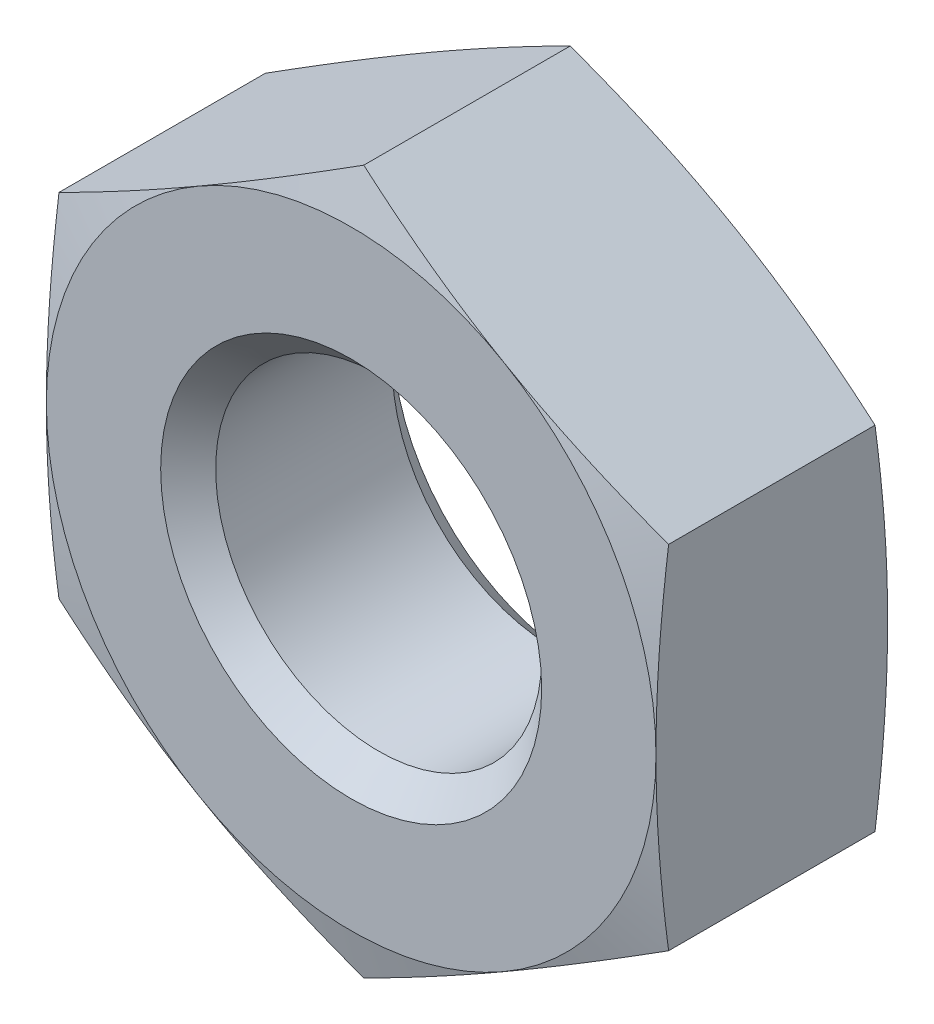
ISO-10303-21;
HEADER;
FILE_DESCRIPTION(('STEP AP214'),'2;1');
FILE_NAME('part.step','',(''),(''),'','','');
FILE_SCHEMA(('AUTOMOTIVE_DESIGN { 1 0 10303 214 1 1 1 1 }'));
ENDSEC;
DATA;
#1=APPLICATION_CONTEXT('core data for automotive mechanical design processes');
#2=APPLICATION_PROTOCOL_DEFINITION('international standard','automotive_design',2000,#1);
#3=PRODUCT_CONTEXT('',#1,'mechanical');
#4=PRODUCT('Part','Part','',(#3));
#5=PRODUCT_RELATED_PRODUCT_CATEGORY('part','',(#4));
#6=PRODUCT_DEFINITION_FORMATION('','',#4);
#7=PRODUCT_DEFINITION_CONTEXT('part definition',#1,'design');
#8=PRODUCT_DEFINITION('design','',#6,#7);
#9=PRODUCT_DEFINITION_SHAPE('','',#8);
#10=(LENGTH_UNIT() NAMED_UNIT(*) SI_UNIT(.MILLI.,.METRE.));
#11=(NAMED_UNIT(*) PLANE_ANGLE_UNIT() SI_UNIT($,.RADIAN.));
#12=(NAMED_UNIT(*) SI_UNIT($,.STERADIAN.) SOLID_ANGLE_UNIT());
#13=UNCERTAINTY_MEASURE_WITH_UNIT(LENGTH_MEASURE(1.E-05),#10,'distance_accuracy_value','');
#14=(GEOMETRIC_REPRESENTATION_CONTEXT(3) GLOBAL_UNCERTAINTY_ASSIGNED_CONTEXT((#13)) GLOBAL_UNIT_ASSIGNED_CONTEXT((#10,
#11,#12)) REPRESENTATION_CONTEXT('',''));
#15=CARTESIAN_POINT('',(0.,0.,0.));
#16=DIRECTION('',(0.,0.,1.));
#17=DIRECTION('',(1.,0.,0.));
#18=AXIS2_PLACEMENT_3D('',#15,#16,#17);
#19=CARTESIAN_POINT('',(0.,0.,0.));
#20=DIRECTION('',(0.,0.,-1.));
#21=DIRECTION('',(-1.,0.,0.));
#22=AXIS2_PLACEMENT_3D('',#19,#20,#21);
#23=PLANE('',#22);
#24=CARTESIAN_POINT('',(0.,0.,0.));
#25=DIRECTION('',(0.,0.,1.));
#26=DIRECTION('',(1.,0.,0.));
#27=AXIS2_PLACEMENT_3D('',#24,#25,#26);
#28=CIRCLE('',#27,6.35);
#29=CARTESIAN_POINT('',(6.35,0.,0.));
#30=VERTEX_POINT('',#29);
#31=CARTESIAN_POINT('',(3.17499999999997,5.49926131403117,0.));
#32=VERTEX_POINT('',#31);
#33=EDGE_CURVE('E11',#30,#32,#28,.T.);
#34=ORIENTED_EDGE('',*,*,#33,.T.);
#35=CARTESIAN_POINT('',(-3.17499999999997,5.49926131403117,0.));
#36=VERTEX_POINT('',#35);
#37=EDGE_CURVE('E43',#32,#36,#28,.T.);
#38=ORIENTED_EDGE('',*,*,#37,.T.);
#39=CARTESIAN_POINT('',(-6.35,0.,0.));
#40=VERTEX_POINT('',#39);
#41=EDGE_CURVE('E328',#36,#40,#28,.T.);
#42=ORIENTED_EDGE('',*,*,#41,.T.);
#43=CARTESIAN_POINT('',(-3.17499999999997,-5.49926131403117,0.));
#44=VERTEX_POINT('',#43);
#45=EDGE_CURVE('E321',#40,#44,#28,.T.);
#46=ORIENTED_EDGE('',*,*,#45,.T.);
#47=CARTESIAN_POINT('',(3.17499999999997,-5.49926131403117,0.));
#48=VERTEX_POINT('',#47);
#49=EDGE_CURVE('E324',#44,#48,#28,.T.);
#50=ORIENTED_EDGE('',*,*,#49,.T.);
#51=EDGE_CURVE('E44',#48,#30,#28,.T.);
#52=ORIENTED_EDGE('',*,*,#51,.T.);
#53=EDGE_LOOP('',(#34,#38,#42,#46,#50,#52));
#54=FACE_BOUND('',#53,.T.);
#55=CARTESIAN_POINT('',(0.,0.,0.));
#56=DIRECTION('',(0.,0.,1.));
#57=DIRECTION('',(1.,0.,0.));
#58=AXIS2_PLACEMENT_3D('',#55,#56,#57);
#59=CIRCLE('',#58,3.96875);
#60=CARTESIAN_POINT('',(3.96875,0.,0.));
#61=VERTEX_POINT('',#60);
#62=EDGE_CURVE('E185',#61,#61,#59,.T.);
#63=ORIENTED_EDGE('',*,*,#62,.F.);
#64=EDGE_LOOP('',(#63));
#65=FACE_BOUND('',#64,.T.);
#66=ADVANCED_FACE('F36',(#54,#65),#23,.F.);
#67=CARTESIAN_POINT('',(0.,6.35,-4.826));
#68=DIRECTION('',(0.,0.,1.));
#69=DIRECTION('',(1.,0.,0.));
#70=AXIS2_PLACEMENT_3D('',#67,#68,#69);
#71=PLANE('',#70);
#72=CARTESIAN_POINT('',(0.,0.,-4.826));
#73=DIRECTION('',(0.,0.,1.));
#74=DIRECTION('',(1.,0.,0.));
#75=AXIS2_PLACEMENT_3D('',#72,#73,#74);
#76=CIRCLE('',#75,6.35);
#77=CARTESIAN_POINT('',(6.35,0.,-4.826));
#78=VERTEX_POINT('',#77);
#79=CARTESIAN_POINT('',(3.17499999999997,5.49926131403117,-4.826));
#80=VERTEX_POINT('',#79);
#81=EDGE_CURVE('E359',#78,#80,#76,.T.);
#82=ORIENTED_EDGE('',*,*,#81,.F.);
#83=CARTESIAN_POINT('',(3.17499999999997,-5.49926131403117,-4.826));
#84=VERTEX_POINT('',#83);
#85=EDGE_CURVE('E362',#84,#78,#76,.T.);
#86=ORIENTED_EDGE('',*,*,#85,.F.);
#87=CARTESIAN_POINT('',(-3.17499999999997,-5.49926131403117,-4.826));
#88=VERTEX_POINT('',#87);
#89=EDGE_CURVE('E363',#88,#84,#76,.T.);
#90=ORIENTED_EDGE('',*,*,#89,.F.);
#91=CARTESIAN_POINT('',(-6.35,0.,-4.826));
#92=VERTEX_POINT('',#91);
#93=EDGE_CURVE('E143',#92,#88,#76,.T.);
#94=ORIENTED_EDGE('',*,*,#93,.F.);
#95=CARTESIAN_POINT('',(-3.17499999999997,5.49926131403117,-4.826));
#96=VERTEX_POINT('',#95);
#97=EDGE_CURVE('E360',#96,#92,#76,.T.);
#98=ORIENTED_EDGE('',*,*,#97,.F.);
#99=EDGE_CURVE('E356',#80,#96,#76,.T.);
#100=ORIENTED_EDGE('',*,*,#99,.F.);
#101=EDGE_LOOP('',(#82,#86,#90,#94,#98,#100));
#102=FACE_BOUND('',#101,.T.);
#103=CARTESIAN_POINT('',(0.,0.,-4.826));
#104=DIRECTION('',(0.,0.,1.));
#105=DIRECTION('',(1.,0.,0.));
#106=AXIS2_PLACEMENT_3D('',#103,#104,#105);
#107=CIRCLE('',#106,3.96875);
#108=CARTESIAN_POINT('',(3.96875,0.,-4.826));
#109=VERTEX_POINT('',#108);
#110=EDGE_CURVE('E205',#109,#109,#107,.T.);
#111=ORIENTED_EDGE('',*,*,#110,.T.);
#112=EDGE_LOOP('',(#111));
#113=FACE_BOUND('',#112,.T.);
#114=ADVANCED_FACE('F209',(#102,#113),#71,.F.);
#115=CARTESIAN_POINT('',(0.,0.,-0.34029547438753));
#116=DIRECTION('',(0.,0.,-1.));
#117=DIRECTION('',(-1.,0.,0.));
#118=AXIS2_PLACEMENT_3D('',#115,#116,#117);
#119=CONICAL_SURFACE('',#118,7.62,1.30899693899574);
#120=CARTESIAN_POINT('',(-6.3502,3.66605873930026,-0.263250406317398));
#121=CARTESIAN_POINT('',(-6.08648388036055,3.81831531196374,-0.222436017819721));
#122=CARTESIAN_POINT('',(-5.82228961017329,3.97084794497471,-0.185383274224434));
#123=CARTESIAN_POINT('',(-5.29296803853939,4.27645189684542,-0.120285061182736));
#124=CARTESIAN_POINT('',(-5.02784040218128,4.42952340906638,-0.0922432503895779));
#125=CARTESIAN_POINT('',(-4.49825958402999,4.73527703698369,-0.0468039793310918));
#126=CARTESIAN_POINT('',(-4.23380998333527,4.88795708513187,-0.0293523302928602));
#127=CARTESIAN_POINT('',(-3.70457353831061,5.19351188913182,-0.00595145337441143));
#128=CARTESIAN_POINT('',(-3.4397867691553,5.34638660158149,0.));
#129=CARTESIAN_POINT('',(-2.9102132308447,5.65213602648081,0.));
#130=CARTESIAN_POINT('',(-2.64542646168939,5.80501073893048,-0.0059514533744095));
#131=CARTESIAN_POINT('',(-2.11619001666473,6.11056554293043,-0.0293523302928565));
#132=CARTESIAN_POINT('',(-1.85174041597001,6.26324559107861,-0.0468039793310874));
#133=CARTESIAN_POINT('',(-1.32215959781872,6.56899921899592,-0.092243250389572));
#134=CARTESIAN_POINT('',(-1.05703196146061,6.72207073121688,-0.120285061182729));
#135=CARTESIAN_POINT('',(-0.527710389826715,7.02767468308759,-0.185383274224426));
#136=CARTESIAN_POINT('',(-0.263516119639453,7.18020731609856,-0.222436017819712));
#137=CARTESIAN_POINT('',(0.000199999999999172,7.33246388876204,-0.263250406317389));
#138=B_SPLINE_CURVE_WITH_KNOTS('',3,(#120,#121,#122,#123,#124,#125,#126,#127,#128,#129,#130,
#131,#132,#133,#134,#135,#136,#137),.UNSPECIFIED.,.F.,.F.,(4,2,2,2,2,2,2,2,4),(0.,
0.921756832598808,1.84388744891418,2.76125893137181,3.6784528682018,4.5956468050318,
5.51301828748942,6.43514890380479,7.3569057364036),.UNSPECIFIED.);
#139=CARTESIAN_POINT('',(-6.35,3.6661742093541,-0.263219465478865));
#140=VERTEX_POINT('',#139);
#141=EDGE_CURVE('E336',#140,#36,#138,.T.);
#142=ORIENTED_EDGE('',*,*,#141,.F.);
#143=CARTESIAN_POINT('',(-6.35,-9.69838426805785,-1.40466702488971));
#144=CARTESIAN_POINT('',(-6.35,-9.41030301778577,-1.34010443577546));
#145=CARTESIAN_POINT('',(-6.35,-9.12204158174623,-1.27633145008312));
#146=CARTESIAN_POINT('',(-6.35,-8.54506984640149,-1.15079089411719));
#147=CARTESIAN_POINT('',(-6.35,-8.25635952827311,-1.08902341045539));
#148=CARTESIAN_POINT('',(-6.35,-7.67814291234007,-0.967866314966913));
#149=CARTESIAN_POINT('',(-6.35,-7.3886361115347,-0.908479095146425));
#150=CARTESIAN_POINT('',(-6.35,-6.80901992928611,-0.792723548009877));
#151=CARTESIAN_POINT('',(-6.35,-6.51891055295002,-0.736355195214979));
#152=CARTESIAN_POINT('',(-6.35,-5.94029809901698,-0.627790684302113));
#153=CARTESIAN_POINT('',(-6.35,-5.65180060822269,-0.575564896732133));
#154=CARTESIAN_POINT('',(-6.35,-5.07401869356081,-0.475672890671666));
#155=CARTESIAN_POINT('',(-6.35,-4.78473428715288,-0.428006571853227));
#156=CARTESIAN_POINT('',(-6.35,-4.20532238402886,-0.338306756100279));
#157=CARTESIAN_POINT('',(-6.35,-3.91519499560399,-0.296272565730986));
#158=CARTESIAN_POINT('',(-6.35,-3.33401697616172,-0.219075685672323));
#159=CARTESIAN_POINT('',(-6.35,-3.04296634427965,-0.183913002420567));
#160=CARTESIAN_POINT('',(-6.35,-2.45665824634269,-0.121454817676818));
#161=CARTESIAN_POINT('',(-6.35,-2.16139060466994,-0.0942534192876337));
#162=CARTESIAN_POINT('',(-6.35,-1.57011301394939,-0.0495943084176451));
#163=CARTESIAN_POINT('',(-6.35,-1.27410308208168,-0.0321363724800896));
#164=CARTESIAN_POINT('',(-6.35,-0.681770300562421,-0.00798240375551781));
#165=CARTESIAN_POINT('',(-6.35,-0.385447654437733,-0.00128148035654096));
#166=CARTESIAN_POINT('',(-6.35,0.207240251875498,0.000946477245870253));
#167=CARTESIAN_POINT('',(-6.35,0.503605512027085,-0.00352647891836721));
#168=CARTESIAN_POINT('',(-6.35,1.09704066442558,-0.023394736931719));
#169=CARTESIAN_POINT('',(-6.35,1.39410920235126,-0.0388296802873379));
#170=CARTESIAN_POINT('',(-6.35,1.98754764225961,-0.0797408625417562));
#171=CARTESIAN_POINT('',(-6.35,2.28391752862871,-0.10521732374948));
#172=CARTESIAN_POINT('',(-6.35,2.87595617269924,-0.164924646283747));
#173=CARTESIAN_POINT('',(-6.35,3.17162434526447,-0.199161220777022));
#174=CARTESIAN_POINT('',(-6.35,3.76200915366186,-0.274964164720037));
#175=CARTESIAN_POINT('',(-6.35,4.05672578650359,-0.316530557182693));
#176=CARTESIAN_POINT('',(-6.35,4.62575387237953,-0.402712469571084));
#177=CARTESIAN_POINT('',(-6.35,4.90012411114157,-0.446943764115485));
#178=CARTESIAN_POINT('',(-6.35,5.44814142504119,-0.539699756252792));
#179=CARTESIAN_POINT('',(-6.35,5.72178848023886,-0.58822457098237));
#180=CARTESIAN_POINT('',(-6.35,6.26845955153548,-0.68878209740399));
#181=CARTESIAN_POINT('',(-6.35,6.54148350952887,-0.740815123453308));
#182=CARTESIAN_POINT('',(-6.35,7.08697067406693,-0.847748642018926));
#183=CARTESIAN_POINT('',(-6.35,7.35943387329874,-0.902649171687131));
#184=CARTESIAN_POINT('',(-6.35,8.17622346067864,-1.0708729886187));
#185=CARTESIAN_POINT('',(-6.35,8.71982837771631,-1.18769564959295));
#186=CARTESIAN_POINT('',(-6.35,9.80559255217725,-1.42766515355374));
#187=CARTESIAN_POINT('',(-6.35,10.3477518922184,-1.55081162660151));
#188=CARTESIAN_POINT('',(-6.35,11.4257140626813,-1.80032773599102));
#189=CARTESIAN_POINT('',(-6.35,11.9615270045757,-1.92665380913502));
#190=CARTESIAN_POINT('',(-6.35,13.0324053809716,-2.18246858680105));
#191=CARTESIAN_POINT('',(-6.35,13.5674708016671,-2.31195734893886));
#192=CARTESIAN_POINT('',(-6.35,14.6363696574165,-2.57311038231074));
#193=CARTESIAN_POINT('',(-6.35,15.170203797964,-2.70477177171457));
#194=CARTESIAN_POINT('',(-6.35,16.2374070760912,-2.9698923578487));
#195=CARTESIAN_POINT('',(-6.35,16.7707762284351,-3.1033514951061));
#196=CARTESIAN_POINT('',(-6.35,17.3039833168732,-3.23744729103115));
#197=B_SPLINE_CURVE_WITH_KNOTS('',3,(#143,#144,#145,#146,#147,#148,#149,#150,#151,#152,#153,
#154,#155,#156,#157,#158,#159,#160,#161,#162,#163,#164,#165,#166,#167,#168,#169,#170,#171,#172,
#173,#174,#175,#176,#177,#178,#179,#180,#181,#182,#183,#184,#185,#186,#187,#188,#189,#190,#191,
#192,#193,#194,#195,#196),.UNSPECIFIED.,.F.,.F.,(4,2,2,2,2,2,2,2,2,2,2,2,2,2,2,2,2,2,2,2,2,2,2,
2,2,2,4),(0.,0.885685382727037,1.77140896488686,2.65800139626922,3.54458634374933,
4.42411668165104,5.30362766164224,6.18303025542908,7.0624336730855,7.95184681727801,
8.84123956281448,9.73022783657676,10.6192153439961,11.5114341481121,12.4036727061486,
13.296494653743,14.1893194045178,15.0230171405754,15.8567376287573,16.6905329229565,
17.5243390226424,19.1923219414635,20.8602073953098,22.5117034473379,24.1632296077129,
25.8127177370049,27.4621514314816),.UNSPECIFIED.);
#198=EDGE_CURVE('E154',#40,#140,#197,.T.);
#199=ORIENTED_EDGE('',*,*,#198,.F.);
#200=ORIENTED_EDGE('',*,*,#41,.F.);
#201=EDGE_LOOP('',(#142,#199,#200));
#202=FACE_BOUND('',#201,.T.);
#203=ADVANCED_FACE('F227',(#202),#119,.T.);
#204=CARTESIAN_POINT('',(0.,7.3323484187082,-0.263219465478856));
#205=VERTEX_POINT('',#204);
#206=EDGE_CURVE('E333',#36,#205,#138,.T.);
#207=ORIENTED_EDGE('',*,*,#206,.F.);
#208=ORIENTED_EDGE('',*,*,#37,.F.);
#209=CARTESIAN_POINT('',(-0.000200000000000217,7.33246388876204,-0.263250406317389));
#210=CARTESIAN_POINT('',(0.263516119639452,7.18020731609856,-0.222436017819712));
#211=CARTESIAN_POINT('',(0.527710389826713,7.02767468308759,-0.185383274224427));
#212=CARTESIAN_POINT('',(1.05703196146061,6.72207073121688,-0.120285061182729));
#213=CARTESIAN_POINT('',(1.32215959781872,6.56899921899592,-0.0922432503895723));
#214=CARTESIAN_POINT('',(1.85174041597001,6.26324559107861,-0.0468039793310876));
#215=CARTESIAN_POINT('',(2.11619001666473,6.11056554293043,-0.0293523302928567));
#216=CARTESIAN_POINT('',(2.64542646168939,5.80501073893048,-0.00595145337440971));
#217=CARTESIAN_POINT('',(2.9102132308447,5.65213602648082,0.));
#218=CARTESIAN_POINT('',(3.4397867691553,5.34638660158149,0.));
#219=CARTESIAN_POINT('',(3.7045735383106,5.19351188913182,-0.00595145337441139));
#220=CARTESIAN_POINT('',(4.23380998333527,4.88795708513187,-0.0293523302928601));
#221=CARTESIAN_POINT('',(4.49825958402999,4.73527703698369,-0.0468039793310919));
#222=CARTESIAN_POINT('',(5.02784040218128,4.42952340906638,-0.0922432503895779));
#223=CARTESIAN_POINT('',(5.29296803853939,4.27645189684542,-0.120285061182736));
#224=CARTESIAN_POINT('',(5.82228961017328,3.97084794497471,-0.185383274224434));
#225=CARTESIAN_POINT('',(6.08648388036054,3.81831531196374,-0.22243601781972));
#226=CARTESIAN_POINT('',(6.3502,3.66605873930026,-0.263250406317398));
#227=B_SPLINE_CURVE_WITH_KNOTS('',3,(#209,#210,#211,#212,#213,#214,#215,#216,#217,#218,#219,
#220,#221,#222,#223,#224,#225,#226),.UNSPECIFIED.,.F.,.F.,(4,2,2,2,2,2,2,2,4),(0.,
0.921756832598807,1.84388744891418,2.76125893137181,3.6784528682018,4.59564680503179,
5.51301828748942,6.43514890380479,7.3569057364036),.UNSPECIFIED.);
#228=EDGE_CURVE('E266',#205,#32,#227,.T.);
#229=ORIENTED_EDGE('',*,*,#228,.F.);
#230=EDGE_LOOP('',(#207,#208,#229));
#231=FACE_BOUND('',#230,.T.);
#232=ADVANCED_FACE('F275',(#231),#119,.T.);
#233=CARTESIAN_POINT('',(6.35,3.6661742093541,-0.263219465478865));
#234=VERTEX_POINT('',#233);
#235=EDGE_CURVE('E261',#32,#234,#227,.T.);
#236=ORIENTED_EDGE('',*,*,#235,.F.);
#237=ORIENTED_EDGE('',*,*,#33,.F.);
#238=CARTESIAN_POINT('',(6.35,-9.69838426805785,-1.40466702488971));
#239=CARTESIAN_POINT('',(6.35,-9.41030301778577,-1.34010443577546));
#240=CARTESIAN_POINT('',(6.35,-9.12204158174623,-1.27633145008312));
#241=CARTESIAN_POINT('',(6.35,-8.54506984640149,-1.15079089411719));
#242=CARTESIAN_POINT('',(6.35,-8.25635952827311,-1.08902341045539));
#243=CARTESIAN_POINT('',(6.35,-7.67814291234007,-0.967866314966913));
#244=CARTESIAN_POINT('',(6.35,-7.3886361115347,-0.908479095146425));
#245=CARTESIAN_POINT('',(6.35,-6.80901992928611,-0.792723548009877));
#246=CARTESIAN_POINT('',(6.35,-6.51891055295002,-0.736355195214979));
#247=CARTESIAN_POINT('',(6.35,-5.94029809901698,-0.627790684302113));
#248=CARTESIAN_POINT('',(6.35,-5.65180060822269,-0.575564896732133));
#249=CARTESIAN_POINT('',(6.35,-5.07401869356081,-0.475672890671666));
#250=CARTESIAN_POINT('',(6.35,-4.78473428715288,-0.428006571853227));
#251=CARTESIAN_POINT('',(6.35,-4.20532238402886,-0.338306756100279));
#252=CARTESIAN_POINT('',(6.35,-3.91519499560399,-0.296272565730986));
#253=CARTESIAN_POINT('',(6.35,-3.33401697616172,-0.219075685672323));
#254=CARTESIAN_POINT('',(6.35,-3.04296634427965,-0.183913002420567));
#255=CARTESIAN_POINT('',(6.35,-2.45665824634269,-0.121454817676818));
#256=CARTESIAN_POINT('',(6.35,-2.16139060466994,-0.0942534192876337));
#257=CARTESIAN_POINT('',(6.35,-1.57011301394939,-0.0495943084176451));
#258=CARTESIAN_POINT('',(6.35,-1.27410308208168,-0.0321363724800896));
#259=CARTESIAN_POINT('',(6.35,-0.681770300562421,-0.00798240375551781));
#260=CARTESIAN_POINT('',(6.35,-0.385447654437733,-0.00128148035654096));
#261=CARTESIAN_POINT('',(6.35,0.207240251875498,0.000946477245870253));
#262=CARTESIAN_POINT('',(6.35,0.503605512027085,-0.00352647891836721));
#263=CARTESIAN_POINT('',(6.35,1.09704066442558,-0.023394736931719));
#264=CARTESIAN_POINT('',(6.35,1.39410920235126,-0.0388296802873379));
#265=CARTESIAN_POINT('',(6.35,1.98754764225961,-0.0797408625417562));
#266=CARTESIAN_POINT('',(6.35,2.28391752862871,-0.10521732374948));
#267=CARTESIAN_POINT('',(6.35,2.87595617269924,-0.164924646283747));
#268=CARTESIAN_POINT('',(6.35,3.17162434526447,-0.199161220777022));
#269=CARTESIAN_POINT('',(6.35,3.76200915366186,-0.274964164720037));
#270=CARTESIAN_POINT('',(6.35,4.05672578650359,-0.316530557182693));
#271=CARTESIAN_POINT('',(6.35,4.62575387237953,-0.402712469571084));
#272=CARTESIAN_POINT('',(6.35,4.90012411114157,-0.446943764115485));
#273=CARTESIAN_POINT('',(6.35,5.44814142504119,-0.539699756252792));
#274=CARTESIAN_POINT('',(6.35,5.72178848023886,-0.58822457098237));
#275=CARTESIAN_POINT('',(6.35,6.26845955153548,-0.68878209740399));
#276=CARTESIAN_POINT('',(6.35,6.54148350952887,-0.740815123453308));
#277=CARTESIAN_POINT('',(6.35,7.08697067406693,-0.847748642018926));
#278=CARTESIAN_POINT('',(6.35,7.35943387329874,-0.902649171687131));
#279=CARTESIAN_POINT('',(6.35,8.17622346067864,-1.0708729886187));
#280=CARTESIAN_POINT('',(6.35,8.71982837771631,-1.18769564959295));
#281=CARTESIAN_POINT('',(6.35,9.80559255217725,-1.42766515355374));
#282=CARTESIAN_POINT('',(6.35,10.3477518922184,-1.55081162660151));
#283=CARTESIAN_POINT('',(6.35,11.4257140626813,-1.80032773599102));
#284=CARTESIAN_POINT('',(6.35,11.9615270045757,-1.92665380913502));
#285=CARTESIAN_POINT('',(6.35,13.0324053809716,-2.18246858680105));
#286=CARTESIAN_POINT('',(6.35,13.5674708016671,-2.31195734893886));
#287=CARTESIAN_POINT('',(6.35,14.6363696574165,-2.57311038231074));
#288=CARTESIAN_POINT('',(6.35,15.170203797964,-2.70477177171457));
#289=CARTESIAN_POINT('',(6.35,16.2374070760912,-2.9698923578487));
#290=CARTESIAN_POINT('',(6.35,16.7707762284351,-3.1033514951061));
#291=CARTESIAN_POINT('',(6.35,17.3039833168732,-3.23744729103115));
#292=B_SPLINE_CURVE_WITH_KNOTS('',3,(#238,#239,#240,#241,#242,#243,#244,#245,#246,#247,#248,
#249,#250,#251,#252,#253,#254,#255,#256,#257,#258,#259,#260,#261,#262,#263,#264,#265,#266,#267,
#268,#269,#270,#271,#272,#273,#274,#275,#276,#277,#278,#279,#280,#281,#282,#283,#284,#285,#286,
#287,#288,#289,#290,#291),.UNSPECIFIED.,.F.,.F.,(4,2,2,2,2,2,2,2,2,2,2,2,2,2,2,2,2,2,2,2,2,2,2,
2,2,2,4),(0.,0.885685382727037,1.77140896488686,2.65800139626922,3.54458634374933,
4.42411668165104,5.30362766164224,6.18303025542908,7.0624336730855,7.95184681727801,
8.84123956281448,9.73022783657676,10.6192153439961,11.5114341481121,12.4036727061486,
13.296494653743,14.1893194045178,15.0230171405754,15.8567376287573,16.6905329229565,
17.5243390226424,19.1923219414635,20.8602073953098,22.5117034473379,24.1632296077129,
25.8127177370049,27.4621514314816),.UNSPECIFIED.);
#293=EDGE_CURVE('E293',#234,#30,#292,.F.);
#294=ORIENTED_EDGE('',*,*,#293,.F.);
#295=EDGE_LOOP('',(#236,#237,#294));
#296=FACE_BOUND('',#295,.T.);
#297=ADVANCED_FACE('F347',(#296),#119,.T.);
#298=CARTESIAN_POINT('',(6.35,-3.6661742093541,-0.263219465478865));
#299=VERTEX_POINT('',#298);
#300=EDGE_CURVE('E289',#30,#299,#292,.F.);
#301=ORIENTED_EDGE('',*,*,#300,.F.);
#302=ORIENTED_EDGE('',*,*,#51,.F.);
#303=CARTESIAN_POINT('',(6.3502,-3.66605873930026,-0.263250406317398));
#304=CARTESIAN_POINT('',(6.08648388036055,-3.81831531196374,-0.222436017819721));
#305=CARTESIAN_POINT('',(5.82228961017329,-3.97084794497471,-0.185383274224434));
#306=CARTESIAN_POINT('',(5.29296803853939,-4.27645189684542,-0.120285061182736));
#307=CARTESIAN_POINT('',(5.02784040218128,-4.42952340906638,-0.0922432503895779));
#308=CARTESIAN_POINT('',(4.49825958402999,-4.73527703698369,-0.0468039793310918));
#309=CARTESIAN_POINT('',(4.23380998333527,-4.88795708513187,-0.0293523302928602));
#310=CARTESIAN_POINT('',(3.70457353831061,-5.19351188913182,-0.00595145337441143));
#311=CARTESIAN_POINT('',(3.4397867691553,-5.34638660158149,0.));
#312=CARTESIAN_POINT('',(2.9102132308447,-5.65213602648081,0.));
#313=CARTESIAN_POINT('',(2.64542646168939,-5.80501073893048,-0.0059514533744095));
#314=CARTESIAN_POINT('',(2.11619001666473,-6.11056554293043,-0.0293523302928565));
#315=CARTESIAN_POINT('',(1.85174041597001,-6.26324559107861,-0.0468039793310874));
#316=CARTESIAN_POINT('',(1.32215959781872,-6.56899921899592,-0.092243250389572));
#317=CARTESIAN_POINT('',(1.05703196146061,-6.72207073121688,-0.120285061182729));
#318=CARTESIAN_POINT('',(0.527710389826715,-7.02767468308759,-0.185383274224426));
#319=CARTESIAN_POINT('',(0.263516119639453,-7.18020731609856,-0.222436017819712));
#320=CARTESIAN_POINT('',(-0.000199999999999172,-7.33246388876204,-0.263250406317389));
#321=B_SPLINE_CURVE_WITH_KNOTS('',3,(#303,#304,#305,#306,#307,#308,#309,#310,#311,#312,#313,
#314,#315,#316,#317,#318,#319,#320),.UNSPECIFIED.,.F.,.F.,(4,2,2,2,2,2,2,2,4),(0.,
0.921756832598808,1.84388744891418,2.76125893137181,3.6784528682018,4.5956468050318,
5.51301828748942,6.43514890380479,7.3569057364036),.UNSPECIFIED.);
#322=EDGE_CURVE('E299',#299,#48,#321,.T.);
#323=ORIENTED_EDGE('',*,*,#322,.F.);
#324=EDGE_LOOP('',(#301,#302,#323));
#325=FACE_BOUND('',#324,.T.);
#326=ADVANCED_FACE('F387',(#325),#119,.T.);
#327=CARTESIAN_POINT('',(0.,-7.3323484187082,-0.263219465478856));
#328=VERTEX_POINT('',#327);
#329=EDGE_CURVE('E284',#48,#328,#321,.T.);
#330=ORIENTED_EDGE('',*,*,#329,.F.);
#331=ORIENTED_EDGE('',*,*,#49,.F.);
#332=CARTESIAN_POINT('',(0.000200000000000217,-7.33246388876204,-0.263250406317389));
#333=CARTESIAN_POINT('',(-0.263516119639452,-7.18020731609856,-0.222436017819712));
#334=CARTESIAN_POINT('',(-0.527710389826713,-7.02767468308759,-0.185383274224427));
#335=CARTESIAN_POINT('',(-1.05703196146061,-6.72207073121688,-0.120285061182729));
#336=CARTESIAN_POINT('',(-1.32215959781872,-6.56899921899592,-0.0922432503895723));
#337=CARTESIAN_POINT('',(-1.85174041597001,-6.26324559107861,-0.0468039793310876));
#338=CARTESIAN_POINT('',(-2.11619001666473,-6.11056554293043,-0.0293523302928567));
#339=CARTESIAN_POINT('',(-2.64542646168939,-5.80501073893048,-0.00595145337440971));
#340=CARTESIAN_POINT('',(-2.9102132308447,-5.65213602648082,0.));
#341=CARTESIAN_POINT('',(-3.4397867691553,-5.34638660158149,0.));
#342=CARTESIAN_POINT('',(-3.7045735383106,-5.19351188913182,-0.00595145337441139));
#343=CARTESIAN_POINT('',(-4.23380998333527,-4.88795708513187,-0.0293523302928601));
#344=CARTESIAN_POINT('',(-4.49825958402999,-4.73527703698369,-0.0468039793310919));
#345=CARTESIAN_POINT('',(-5.02784040218128,-4.42952340906638,-0.0922432503895779));
#346=CARTESIAN_POINT('',(-5.29296803853939,-4.27645189684542,-0.120285061182736));
#347=CARTESIAN_POINT('',(-5.82228961017328,-3.97084794497471,-0.185383274224434));
#348=CARTESIAN_POINT('',(-6.08648388036054,-3.81831531196374,-0.22243601781972));
#349=CARTESIAN_POINT('',(-6.3502,-3.66605873930026,-0.263250406317398));
#350=B_SPLINE_CURVE_WITH_KNOTS('',3,(#332,#333,#334,#335,#336,#337,#338,#339,#340,#341,#342,
#343,#344,#345,#346,#347,#348,#349),.UNSPECIFIED.,.F.,.F.,(4,2,2,2,2,2,2,2,4),(0.,
0.921756832598807,1.84388744891418,2.76125893137181,3.6784528682018,4.59564680503179,
5.51301828748942,6.43514890380479,7.3569057364036),.UNSPECIFIED.);
#351=EDGE_CURVE('E146',#328,#44,#350,.T.);
#352=ORIENTED_EDGE('',*,*,#351,.F.);
#353=EDGE_LOOP('',(#330,#331,#352));
#354=FACE_BOUND('',#353,.T.);
#355=ADVANCED_FACE('F325',(#354),#119,.T.);
#356=CARTESIAN_POINT('',(-6.35,-3.6661742093541,-0.263219465478865));
#357=VERTEX_POINT('',#356);
#358=EDGE_CURVE('E138',#44,#357,#350,.T.);
#359=ORIENTED_EDGE('',*,*,#358,.F.);
#360=ORIENTED_EDGE('',*,*,#45,.F.);
#361=EDGE_CURVE('E51',#357,#40,#197,.T.);
#362=ORIENTED_EDGE('',*,*,#361,.F.);
#363=EDGE_LOOP('',(#359,#360,#362));
#364=FACE_BOUND('',#363,.T.);
#365=ADVANCED_FACE('F277',(#364),#119,.T.);
#366=CARTESIAN_POINT('',(0.,7.3323484187082,-4.826));
#367=DIRECTION('',(-0.499999999999998,0.86602540378444,0.));
#368=DIRECTION('',(-0.86602540378444,-0.499999999999998,0.));
#369=AXIS2_PLACEMENT_3D('',#366,#367,#368);
#370=PLANE('',#369);
#371=ORIENTED_EDGE('',*,*,#141,.T.);
#372=ORIENTED_EDGE('',*,*,#206,.T.);
#373=DIRECTION('',(0.,0.,1.));
#374=VECTOR('',#373,1.);
#375=CARTESIAN_POINT('',(0.,7.3323484187082,-4.826));
#376=LINE('',#375,#374);
#377=CARTESIAN_POINT('',(0.,7.3323484187082,-4.56278053452117));
#378=VERTEX_POINT('',#377);
#379=EDGE_CURVE('E131',#378,#205,#376,.T.);
#380=ORIENTED_EDGE('',*,*,#379,.F.);
#381=CARTESIAN_POINT('',(0.000200000000000032,7.33246388876204,-4.56274959368263));
#382=CARTESIAN_POINT('',(-0.263516119639452,7.18020731609856,-4.60356398218031));
#383=CARTESIAN_POINT('',(-0.527710389826713,7.02767468308759,-4.64061672577559));
#384=CARTESIAN_POINT('',(-1.05703196146061,6.72207073121688,-4.70571493881728));
#385=CARTESIAN_POINT('',(-1.32215959781872,6.56899921899592,-4.73375674961044));
#386=CARTESIAN_POINT('',(-1.85174041597001,6.26324559107861,-4.77919602066892));
#387=CARTESIAN_POINT('',(-2.11619001666473,6.11056554293043,-4.79664766970715));
#388=CARTESIAN_POINT('',(-2.64542646168939,5.80501073893048,-4.82004854662559));
#389=CARTESIAN_POINT('',(-2.9102132308447,5.65213602648082,-4.82600000000001));
#390=CARTESIAN_POINT('',(-3.4397867691553,5.34638660158149,-4.82600000000001));
#391=CARTESIAN_POINT('',(-3.70457353831061,5.19351188913182,-4.82004854662559));
#392=CARTESIAN_POINT('',(-4.23380998333527,4.88795708513187,-4.79664766970714));
#393=CARTESIAN_POINT('',(-4.49825958402999,4.73527703698369,-4.77919602066891));
#394=CARTESIAN_POINT('',(-5.02784040218128,4.42952340906638,-4.73375674961043));
#395=CARTESIAN_POINT('',(-5.29296803853939,4.27645189684542,-4.70571493881727));
#396=CARTESIAN_POINT('',(-5.82228961017329,3.97084794497471,-4.64061672577558));
#397=CARTESIAN_POINT('',(-6.08648388036055,3.81831531196374,-4.6035639821803));
#398=CARTESIAN_POINT('',(-6.3502,3.66605873930026,-4.56274959368263));
#399=B_SPLINE_CURVE_WITH_KNOTS('',3,(#381,#382,#383,#384,#385,#386,#387,#388,#389,#390,#391,
#392,#393,#394,#395,#396,#397,#398),.UNSPECIFIED.,.F.,.F.,(4,2,2,2,2,2,2,2,4),(0.,
0.921756832598805,1.84388744891418,2.7612589313718,3.6784528682018,4.59564680503179,
5.51301828748942,6.4351489038048,7.3569057364036),.UNSPECIFIED.);
#400=EDGE_CURVE('E337',#378,#96,#399,.T.);
#401=ORIENTED_EDGE('',*,*,#400,.T.);
#402=CARTESIAN_POINT('',(-6.35,3.6661742093541,-4.56278053452116));
#403=VERTEX_POINT('',#402);
#404=EDGE_CURVE('E268',#96,#403,#399,.T.);
#405=ORIENTED_EDGE('',*,*,#404,.T.);
#406=DIRECTION('',(0.,0.,1.));
#407=VECTOR('',#406,1.);
#408=CARTESIAN_POINT('',(-6.35,3.6661742093541,-4.826));
#409=LINE('',#408,#407);
#410=EDGE_CURVE('E140',#403,#140,#409,.T.);
#411=ORIENTED_EDGE('',*,*,#410,.T.);
#412=EDGE_LOOP('',(#371,#372,#380,#401,#405,#411));
#413=FACE_BOUND('',#412,.T.);
#414=ADVANCED_FACE('F177',(#413),#370,.T.);
#415=CARTESIAN_POINT('',(6.35,3.6661742093541,-4.826));
#416=DIRECTION('',(0.499999999999998,0.86602540378444,0.));
#417=DIRECTION('',(-0.86602540378444,0.499999999999998,0.));
#418=AXIS2_PLACEMENT_3D('',#415,#416,#417);
#419=PLANE('',#418);
#420=ORIENTED_EDGE('',*,*,#228,.T.);
#421=ORIENTED_EDGE('',*,*,#235,.T.);
#422=DIRECTION('',(0.,0.,1.));
#423=VECTOR('',#422,1.);
#424=CARTESIAN_POINT('',(6.35,3.6661742093541,-4.826));
#425=LINE('',#424,#423);
#426=CARTESIAN_POINT('',(6.35,3.6661742093541,-4.56278053452116));
#427=VERTEX_POINT('',#426);
#428=EDGE_CURVE('E192',#427,#234,#425,.T.);
#429=ORIENTED_EDGE('',*,*,#428,.F.);
#430=CARTESIAN_POINT('',(6.3502,3.66605873930026,-4.56274959368263));
#431=CARTESIAN_POINT('',(6.08648388036055,3.81831531196374,-4.6035639821803));
#432=CARTESIAN_POINT('',(5.82228961017329,3.97084794497471,-4.64061672577558));
#433=CARTESIAN_POINT('',(5.29296803853939,4.27645189684542,-4.70571493881727));
#434=CARTESIAN_POINT('',(5.02784040218128,4.42952340906638,-4.73375674961043));
#435=CARTESIAN_POINT('',(4.49825958402999,4.73527703698369,-4.77919602066891));
#436=CARTESIAN_POINT('',(4.23380998333527,4.88795708513187,-4.79664766970714));
#437=CARTESIAN_POINT('',(3.70457353831061,5.19351188913182,-4.82004854662559));
#438=CARTESIAN_POINT('',(3.4397867691553,5.34638660158149,-4.82600000000001));
#439=CARTESIAN_POINT('',(2.9102132308447,5.65213602648082,-4.82600000000001));
#440=CARTESIAN_POINT('',(2.64542646168939,5.80501073893048,-4.82004854662559));
#441=CARTESIAN_POINT('',(2.11619001666473,6.11056554293043,-4.79664766970714));
#442=CARTESIAN_POINT('',(1.85174041597001,6.26324559107861,-4.77919602066892));
#443=CARTESIAN_POINT('',(1.32215959781872,6.56899921899592,-4.73375674961044));
#444=CARTESIAN_POINT('',(1.05703196146061,6.72207073121688,-4.70571493881728));
#445=CARTESIAN_POINT('',(0.527710389826711,7.02767468308759,-4.64061672577559));
#446=CARTESIAN_POINT('',(0.26351611963945,7.18020731609856,-4.60356398218031));
#447=CARTESIAN_POINT('',(-0.000200000000001609,7.33246388876204,-4.56274959368263));
#448=B_SPLINE_CURVE_WITH_KNOTS('',3,(#430,#431,#432,#433,#434,#435,#436,#437,#438,#439,#440,
#441,#442,#443,#444,#445,#446,#447),.UNSPECIFIED.,.F.,.F.,(4,2,2,2,2,2,2,2,4),(0.,
0.921756832598805,1.84388744891418,2.7612589313718,3.6784528682018,4.59564680503179,
5.51301828748942,6.4351489038048,7.3569057364036),.UNSPECIFIED.);
#449=EDGE_CURVE('E267',#427,#80,#448,.T.);
#450=ORIENTED_EDGE('',*,*,#449,.T.);
#451=EDGE_CURVE('E255',#80,#378,#448,.T.);
#452=ORIENTED_EDGE('',*,*,#451,.T.);
#453=ORIENTED_EDGE('',*,*,#379,.T.);
#454=EDGE_LOOP('',(#420,#421,#429,#450,#452,#453));
#455=FACE_BOUND('',#454,.T.);
#456=ADVANCED_FACE('F247',(#455),#419,.T.);
#457=CARTESIAN_POINT('',(6.35,-3.6661742093541,-4.826));
#458=DIRECTION('',(1.,0.,0.));
#459=DIRECTION('',(0.,0.,-1.));
#460=AXIS2_PLACEMENT_3D('',#457,#458,#459);
#461=PLANE('',#460);
#462=ORIENTED_EDGE('',*,*,#293,.T.);
#463=ORIENTED_EDGE('',*,*,#300,.T.);
#464=DIRECTION('',(0.,0.,1.));
#465=VECTOR('',#464,1.);
#466=CARTESIAN_POINT('',(6.35,-3.6661742093541,-4.826));
#467=LINE('',#466,#465);
#468=CARTESIAN_POINT('',(6.35,-3.6661742093541,-4.56278053452116));
#469=VERTEX_POINT('',#468);
#470=EDGE_CURVE('E189',#469,#299,#467,.T.);
#471=ORIENTED_EDGE('',*,*,#470,.F.);
#472=CARTESIAN_POINT('',(6.35,-9.69838426805784,-3.42133297511041));
#473=CARTESIAN_POINT('',(6.35,-9.41030301778576,-3.48589556422467));
#474=CARTESIAN_POINT('',(6.35,-9.12204158174623,-3.549668549917));
#475=CARTESIAN_POINT('',(6.35,-8.54506984640148,-3.67520910588292));
#476=CARTESIAN_POINT('',(6.35,-8.25635952827311,-3.73697658954471));
#477=CARTESIAN_POINT('',(6.35,-7.67814291234006,-3.85813368503318));
#478=CARTESIAN_POINT('',(6.35,-7.38863611153469,-3.91752090485366));
#479=CARTESIAN_POINT('',(6.35,-6.80901992928611,-4.0332764519902));
#480=CARTESIAN_POINT('',(6.35,-6.51891055295002,-4.08964480478509));
#481=CARTESIAN_POINT('',(6.35,-5.94029809901698,-4.19820931569794));
#482=CARTESIAN_POINT('',(6.35,-5.65180060822268,-4.25043510326792));
#483=CARTESIAN_POINT('',(6.35,-5.07401869356081,-4.35032710932838));
#484=CARTESIAN_POINT('',(6.35,-4.78473428715288,-4.39799342814681));
#485=CARTESIAN_POINT('',(6.35,-4.20532238402886,-4.48769324389975));
#486=CARTESIAN_POINT('',(6.35,-3.91519499560398,-4.52972743426904));
#487=CARTESIAN_POINT('',(6.35,-3.33401697616172,-4.6069243143277));
#488=CARTESIAN_POINT('',(6.35,-3.04296634427965,-4.64208699757945));
#489=CARTESIAN_POINT('',(6.35,-2.45665824634269,-4.70454518232319));
#490=CARTESIAN_POINT('',(6.35,-2.16139060466995,-4.73174658071237));
#491=CARTESIAN_POINT('',(6.35,-1.57011301394939,-4.77640569158236));
#492=CARTESIAN_POINT('',(6.35,-1.27410308208168,-4.79386362751991));
#493=CARTESIAN_POINT('',(6.35,-0.681770300562429,-4.81801759624448));
#494=CARTESIAN_POINT('',(6.35,-0.385447654437742,-4.82471851964346));
#495=CARTESIAN_POINT('',(6.35,0.207240251875485,-4.82694647724587));
#496=CARTESIAN_POINT('',(6.35,0.503605512027072,-4.82247352108163));
#497=CARTESIAN_POINT('',(6.35,1.09704066442556,-4.80260526306828));
#498=CARTESIAN_POINT('',(6.35,1.39410920235124,-4.78717031971267));
#499=CARTESIAN_POINT('',(6.35,1.98754764225959,-4.74625913745825));
#500=CARTESIAN_POINT('',(6.35,2.28391752862868,-4.72078267625053));
#501=CARTESIAN_POINT('',(6.35,2.87595617269922,-4.66107535371627));
#502=CARTESIAN_POINT('',(6.35,3.17162434526444,-4.626838779223));
#503=CARTESIAN_POINT('',(6.35,3.76200915366183,-4.55103583527999));
#504=CARTESIAN_POINT('',(6.35,4.05672578650356,-4.50946944281734));
#505=CARTESIAN_POINT('',(6.35,4.6257538723795,-4.42328753042896));
#506=CARTESIAN_POINT('',(6.35,4.90012411114154,-4.37905623588456));
#507=CARTESIAN_POINT('',(6.35,5.44814142504116,-4.28630024374726));
#508=CARTESIAN_POINT('',(6.35,5.72178848023882,-4.23777542901769));
#509=CARTESIAN_POINT('',(6.35,6.26845955153545,-4.13721790259608));
#510=CARTESIAN_POINT('',(6.35,6.54148350952884,-4.08518487654676));
#511=CARTESIAN_POINT('',(6.35,7.0869706740669,-3.97825135798116));
#512=CARTESIAN_POINT('',(6.35,7.35943387329871,-3.92335082831296));
#513=CARTESIAN_POINT('',(6.35,8.17622346067861,-3.7551270113814));
#514=CARTESIAN_POINT('',(6.35,8.71982837771628,-3.63830435040716));
#515=CARTESIAN_POINT('',(6.35,9.80559255217722,-3.39833484644639));
#516=CARTESIAN_POINT('',(6.35,10.3477518922184,-3.27518837339864));
#517=CARTESIAN_POINT('',(6.35,11.4257140626813,-3.02567226400915));
#518=CARTESIAN_POINT('',(6.35,11.9615270045757,-2.89934619086516));
#519=CARTESIAN_POINT('',(6.35,13.0324053809715,-2.64353141319916));
#520=CARTESIAN_POINT('',(6.35,13.5674708016671,-2.51404265106135));
#521=CARTESIAN_POINT('',(6.35,14.6363696574165,-2.2528896176895));
#522=CARTESIAN_POINT('',(6.35,15.170203797964,-2.12122822828567));
#523=CARTESIAN_POINT('',(6.35,16.2374070760912,-1.85610764215157));
#524=CARTESIAN_POINT('',(6.35,16.7707762284352,-1.72264850489418));
#525=CARTESIAN_POINT('',(6.35,17.3039833168732,-1.58855270896914));
#526=B_SPLINE_CURVE_WITH_KNOTS('',3,(#472,#473,#474,#475,#476,#477,#478,#479,#480,#481,#482,
#483,#484,#485,#486,#487,#488,#489,#490,#491,#492,#493,#494,#495,#496,#497,#498,#499,#500,#501,
#502,#503,#504,#505,#506,#507,#508,#509,#510,#511,#512,#513,#514,#515,#516,#517,#518,#519,#520,
#521,#522,#523,#524,#525),.UNSPECIFIED.,.F.,.F.,(4,2,2,2,2,2,2,2,2,2,2,2,2,2,2,2,2,2,2,2,2,2,2,
2,2,2,4),(0.,0.885685382727031,1.77140896488686,2.65800139626921,3.54458634374931,
4.42411668165102,5.30362766164221,6.18303025542906,7.06243367308547,7.95184681727798,
8.84123956281445,9.73022783657671,10.619215343996,11.5114341481121,12.4036727061486,
13.2964946537429,14.1893194045177,15.0230171405753,15.8567376287573,16.6905329229564,
17.5243390226423,19.1923219414634,20.8602073953097,22.5117034473378,24.1632296077128,
25.8127177370048,27.4621514314815),.UNSPECIFIED.);
#527=EDGE_CURVE('E294',#469,#78,#526,.T.);
#528=ORIENTED_EDGE('',*,*,#527,.T.);
#529=EDGE_CURVE('E295',#78,#427,#526,.T.);
#530=ORIENTED_EDGE('',*,*,#529,.T.);
#531=ORIENTED_EDGE('',*,*,#428,.T.);
#532=EDGE_LOOP('',(#462,#463,#471,#528,#530,#531));
#533=FACE_BOUND('',#532,.T.);
#534=ADVANCED_FACE('F250',(#533),#461,.T.);
#535=CARTESIAN_POINT('',(0.,-7.3323484187082,-4.826));
#536=DIRECTION('',(0.499999999999998,-0.86602540378444,0.));
#537=DIRECTION('',(0.86602540378444,0.499999999999998,0.));
#538=AXIS2_PLACEMENT_3D('',#535,#536,#537);
#539=PLANE('',#538);
#540=ORIENTED_EDGE('',*,*,#322,.T.);
#541=ORIENTED_EDGE('',*,*,#329,.T.);
#542=DIRECTION('',(0.,0.,1.));
#543=VECTOR('',#542,1.);
#544=CARTESIAN_POINT('',(0.,-7.3323484187082,-4.826));
#545=LINE('',#544,#543);
#546=CARTESIAN_POINT('',(0.,-7.3323484187082,-4.56278053452117));
#547=VERTEX_POINT('',#546);
#548=EDGE_CURVE('E139',#547,#328,#545,.T.);
#549=ORIENTED_EDGE('',*,*,#548,.F.);
#550=CARTESIAN_POINT('',(-0.000200000000000032,-7.33246388876204,-4.56274959368263));
#551=CARTESIAN_POINT('',(0.263516119639452,-7.18020731609856,-4.60356398218031));
#552=CARTESIAN_POINT('',(0.527710389826713,-7.02767468308759,-4.64061672577559));
#553=CARTESIAN_POINT('',(1.05703196146061,-6.72207073121688,-4.70571493881728));
#554=CARTESIAN_POINT('',(1.32215959781872,-6.56899921899592,-4.73375674961044));
#555=CARTESIAN_POINT('',(1.85174041597001,-6.26324559107861,-4.77919602066892));
#556=CARTESIAN_POINT('',(2.11619001666473,-6.11056554293043,-4.79664766970715));
#557=CARTESIAN_POINT('',(2.64542646168939,-5.80501073893048,-4.82004854662559));
#558=CARTESIAN_POINT('',(2.9102132308447,-5.65213602648082,-4.82600000000001));
#559=CARTESIAN_POINT('',(3.4397867691553,-5.34638660158149,-4.82600000000001));
#560=CARTESIAN_POINT('',(3.70457353831061,-5.19351188913182,-4.82004854662559));
#561=CARTESIAN_POINT('',(4.23380998333527,-4.88795708513187,-4.79664766970714));
#562=CARTESIAN_POINT('',(4.49825958402999,-4.73527703698369,-4.77919602066891));
#563=CARTESIAN_POINT('',(5.02784040218128,-4.42952340906638,-4.73375674961043));
#564=CARTESIAN_POINT('',(5.29296803853939,-4.27645189684542,-4.70571493881727));
#565=CARTESIAN_POINT('',(5.82228961017329,-3.97084794497471,-4.64061672577558));
#566=CARTESIAN_POINT('',(6.08648388036055,-3.81831531196374,-4.6035639821803));
#567=CARTESIAN_POINT('',(6.3502,-3.66605873930026,-4.56274959368263));
#568=B_SPLINE_CURVE_WITH_KNOTS('',3,(#550,#551,#552,#553,#554,#555,#556,#557,#558,#559,#560,
#561,#562,#563,#564,#565,#566,#567),.UNSPECIFIED.,.F.,.F.,(4,2,2,2,2,2,2,2,4),(0.,
0.921756832598805,1.84388744891418,2.7612589313718,3.6784528682018,4.59564680503179,
5.51301828748942,6.4351489038048,7.3569057364036),.UNSPECIFIED.);
#569=EDGE_CURVE('E306',#547,#84,#568,.T.);
#570=ORIENTED_EDGE('',*,*,#569,.T.);
#571=EDGE_CURVE('E308',#84,#469,#568,.T.);
#572=ORIENTED_EDGE('',*,*,#571,.T.);
#573=ORIENTED_EDGE('',*,*,#470,.T.);
#574=EDGE_LOOP('',(#540,#541,#549,#570,#572,#573));
#575=FACE_BOUND('',#574,.T.);
#576=ADVANCED_FACE('F169',(#575),#539,.T.);
#577=CARTESIAN_POINT('',(-6.35,-3.6661742093541,-4.826));
#578=DIRECTION('',(-0.499999999999998,-0.86602540378444,0.));
#579=DIRECTION('',(0.86602540378444,-0.499999999999998,0.));
#580=AXIS2_PLACEMENT_3D('',#577,#578,#579);
#581=PLANE('',#580);
#582=ORIENTED_EDGE('',*,*,#351,.T.);
#583=ORIENTED_EDGE('',*,*,#358,.T.);
#584=DIRECTION('',(0.,0.,1.));
#585=VECTOR('',#584,1.);
#586=CARTESIAN_POINT('',(-6.35,-3.6661742093541,-4.826));
#587=LINE('',#586,#585);
#588=CARTESIAN_POINT('',(-6.35,-3.6661742093541,-4.56278053452116));
#589=VERTEX_POINT('',#588);
#590=EDGE_CURVE('E126',#589,#357,#587,.T.);
#591=ORIENTED_EDGE('',*,*,#590,.F.);
#592=CARTESIAN_POINT('',(-6.3502,-3.66605873930026,-4.56274959368263));
#593=CARTESIAN_POINT('',(-6.08648388036055,-3.81831531196374,-4.6035639821803));
#594=CARTESIAN_POINT('',(-5.82228961017329,-3.97084794497471,-4.64061672577558));
#595=CARTESIAN_POINT('',(-5.29296803853939,-4.27645189684542,-4.70571493881727));
#596=CARTESIAN_POINT('',(-5.02784040218128,-4.42952340906638,-4.73375674961043));
#597=CARTESIAN_POINT('',(-4.49825958402999,-4.73527703698369,-4.77919602066891));
#598=CARTESIAN_POINT('',(-4.23380998333527,-4.88795708513187,-4.79664766970714));
#599=CARTESIAN_POINT('',(-3.70457353831061,-5.19351188913182,-4.82004854662559));
#600=CARTESIAN_POINT('',(-3.4397867691553,-5.34638660158149,-4.82600000000001));
#601=CARTESIAN_POINT('',(-2.9102132308447,-5.65213602648082,-4.82600000000001));
#602=CARTESIAN_POINT('',(-2.64542646168939,-5.80501073893048,-4.82004854662559));
#603=CARTESIAN_POINT('',(-2.11619001666473,-6.11056554293043,-4.79664766970714));
#604=CARTESIAN_POINT('',(-1.85174041597001,-6.26324559107861,-4.77919602066892));
#605=CARTESIAN_POINT('',(-1.32215959781872,-6.56899921899592,-4.73375674961044));
#606=CARTESIAN_POINT('',(-1.05703196146061,-6.72207073121688,-4.70571493881728));
#607=CARTESIAN_POINT('',(-0.527710389826711,-7.02767468308759,-4.64061672577559));
#608=CARTESIAN_POINT('',(-0.26351611963945,-7.18020731609856,-4.60356398218031));
#609=CARTESIAN_POINT('',(0.000200000000001609,-7.33246388876204,-4.56274959368263));
#610=B_SPLINE_CURVE_WITH_KNOTS('',3,(#592,#593,#594,#595,#596,#597,#598,#599,#600,#601,#602,
#603,#604,#605,#606,#607,#608,#609),.UNSPECIFIED.,.F.,.F.,(4,2,2,2,2,2,2,2,4),(0.,
0.921756832598805,1.84388744891418,2.7612589313718,3.6784528682018,4.59564680503179,
5.51301828748942,6.4351489038048,7.3569057364036),.UNSPECIFIED.);
#611=EDGE_CURVE('E135',#589,#88,#610,.T.);
#612=ORIENTED_EDGE('',*,*,#611,.T.);
#613=EDGE_CURVE('E144',#88,#547,#610,.T.);
#614=ORIENTED_EDGE('',*,*,#613,.T.);
#615=ORIENTED_EDGE('',*,*,#548,.T.);
#616=EDGE_LOOP('',(#582,#583,#591,#612,#614,#615));
#617=FACE_BOUND('',#616,.T.);
#618=ADVANCED_FACE('F134',(#617),#581,.T.);
#619=CARTESIAN_POINT('',(-6.35,3.6661742093541,-4.826));
#620=DIRECTION('',(-1.,0.,0.));
#621=DIRECTION('',(0.,0.,1.));
#622=AXIS2_PLACEMENT_3D('',#619,#620,#621);
#623=PLANE('',#622);
#624=ORIENTED_EDGE('',*,*,#361,.T.);
#625=ORIENTED_EDGE('',*,*,#198,.T.);
#626=ORIENTED_EDGE('',*,*,#410,.F.);
#627=CARTESIAN_POINT('',(-6.35,-9.69838426805784,-3.42133297511041));
#628=CARTESIAN_POINT('',(-6.35,-9.41030301778576,-3.48589556422467));
#629=CARTESIAN_POINT('',(-6.35,-9.12204158174623,-3.549668549917));
#630=CARTESIAN_POINT('',(-6.35,-8.54506984640148,-3.67520910588292));
#631=CARTESIAN_POINT('',(-6.35,-8.25635952827311,-3.73697658954471));
#632=CARTESIAN_POINT('',(-6.35,-7.67814291234006,-3.85813368503318));
#633=CARTESIAN_POINT('',(-6.35,-7.38863611153469,-3.91752090485366));
#634=CARTESIAN_POINT('',(-6.35,-6.80901992928611,-4.0332764519902));
#635=CARTESIAN_POINT('',(-6.35,-6.51891055295002,-4.08964480478509));
#636=CARTESIAN_POINT('',(-6.35,-5.94029809901698,-4.19820931569794));
#637=CARTESIAN_POINT('',(-6.35,-5.65180060822268,-4.25043510326792));
#638=CARTESIAN_POINT('',(-6.35,-5.07401869356081,-4.35032710932838));
#639=CARTESIAN_POINT('',(-6.35,-4.78473428715288,-4.39799342814681));
#640=CARTESIAN_POINT('',(-6.35,-4.20532238402886,-4.48769324389975));
#641=CARTESIAN_POINT('',(-6.35,-3.91519499560398,-4.52972743426904));
#642=CARTESIAN_POINT('',(-6.35,-3.33401697616172,-4.6069243143277));
#643=CARTESIAN_POINT('',(-6.35,-3.04296634427965,-4.64208699757945));
#644=CARTESIAN_POINT('',(-6.35,-2.45665824634269,-4.70454518232319));
#645=CARTESIAN_POINT('',(-6.35,-2.16139060466995,-4.73174658071237));
#646=CARTESIAN_POINT('',(-6.35,-1.57011301394939,-4.77640569158236));
#647=CARTESIAN_POINT('',(-6.35,-1.27410308208168,-4.79386362751991));
#648=CARTESIAN_POINT('',(-6.35,-0.681770300562429,-4.81801759624448));
#649=CARTESIAN_POINT('',(-6.35,-0.385447654437742,-4.82471851964346));
#650=CARTESIAN_POINT('',(-6.35,0.207240251875485,-4.82694647724587));
#651=CARTESIAN_POINT('',(-6.35,0.503605512027072,-4.82247352108163));
#652=CARTESIAN_POINT('',(-6.35,1.09704066442556,-4.80260526306828));
#653=CARTESIAN_POINT('',(-6.35,1.39410920235124,-4.78717031971267));
#654=CARTESIAN_POINT('',(-6.35,1.98754764225959,-4.74625913745825));
#655=CARTESIAN_POINT('',(-6.35,2.28391752862868,-4.72078267625053));
#656=CARTESIAN_POINT('',(-6.35,2.87595617269922,-4.66107535371627));
#657=CARTESIAN_POINT('',(-6.35,3.17162434526444,-4.626838779223));
#658=CARTESIAN_POINT('',(-6.35,3.76200915366183,-4.55103583527999));
#659=CARTESIAN_POINT('',(-6.35,4.05672578650356,-4.50946944281734));
#660=CARTESIAN_POINT('',(-6.35,4.6257538723795,-4.42328753042896));
#661=CARTESIAN_POINT('',(-6.35,4.90012411114154,-4.37905623588456));
#662=CARTESIAN_POINT('',(-6.35,5.44814142504116,-4.28630024374726));
#663=CARTESIAN_POINT('',(-6.35,5.72178848023882,-4.23777542901769));
#664=CARTESIAN_POINT('',(-6.35,6.26845955153545,-4.13721790259608));
#665=CARTESIAN_POINT('',(-6.35,6.54148350952884,-4.08518487654676));
#666=CARTESIAN_POINT('',(-6.35,7.0869706740669,-3.97825135798116));
#667=CARTESIAN_POINT('',(-6.35,7.35943387329871,-3.92335082831296));
#668=CARTESIAN_POINT('',(-6.35,8.17622346067861,-3.7551270113814));
#669=CARTESIAN_POINT('',(-6.35,8.71982837771628,-3.63830435040716));
#670=CARTESIAN_POINT('',(-6.35,9.80559255217722,-3.39833484644639));
#671=CARTESIAN_POINT('',(-6.35,10.3477518922184,-3.27518837339864));
#672=CARTESIAN_POINT('',(-6.35,11.4257140626813,-3.02567226400915));
#673=CARTESIAN_POINT('',(-6.35,11.9615270045757,-2.89934619086516));
#674=CARTESIAN_POINT('',(-6.35,13.0324053809715,-2.64353141319916));
#675=CARTESIAN_POINT('',(-6.35,13.5674708016671,-2.51404265106135));
#676=CARTESIAN_POINT('',(-6.35,14.6363696574165,-2.2528896176895));
#677=CARTESIAN_POINT('',(-6.35,15.170203797964,-2.12122822828567));
#678=CARTESIAN_POINT('',(-6.35,16.2374070760912,-1.85610764215157));
#679=CARTESIAN_POINT('',(-6.35,16.7707762284352,-1.72264850489418));
#680=CARTESIAN_POINT('',(-6.35,17.3039833168732,-1.58855270896914));
#681=B_SPLINE_CURVE_WITH_KNOTS('',3,(#627,#628,#629,#630,#631,#632,#633,#634,#635,#636,#637,
#638,#639,#640,#641,#642,#643,#644,#645,#646,#647,#648,#649,#650,#651,#652,#653,#654,#655,#656,
#657,#658,#659,#660,#661,#662,#663,#664,#665,#666,#667,#668,#669,#670,#671,#672,#673,#674,#675,
#676,#677,#678,#679,#680),.UNSPECIFIED.,.F.,.F.,(4,2,2,2,2,2,2,2,2,2,2,2,2,2,2,2,2,2,2,2,2,2,2,
2,2,2,4),(0.,0.885685382727031,1.77140896488686,2.65800139626921,3.54458634374931,
4.42411668165102,5.30362766164221,6.18303025542906,7.06243367308547,7.95184681727798,
8.84123956281445,9.73022783657671,10.619215343996,11.5114341481121,12.4036727061486,
13.2964946537429,14.1893194045177,15.0230171405753,15.8567376287573,16.6905329229564,
17.5243390226423,19.1923219414634,20.8602073953097,22.5117034473378,24.1632296077128,
25.8127177370048,27.4621514314815),.UNSPECIFIED.);
#682=EDGE_CURVE('E58',#403,#92,#681,.F.);
#683=ORIENTED_EDGE('',*,*,#682,.T.);
#684=EDGE_CURVE('E123',#92,#589,#681,.F.);
#685=ORIENTED_EDGE('',*,*,#684,.T.);
#686=ORIENTED_EDGE('',*,*,#590,.T.);
#687=EDGE_LOOP('',(#624,#625,#626,#683,#685,#686));
#688=FACE_BOUND('',#687,.T.);
#689=ADVANCED_FACE('F125',(#688),#623,.T.);
#690=CARTESIAN_POINT('',(0.,0.,-4.826));
#691=DIRECTION('',(0.,0.,1.));
#692=DIRECTION('',(1.,0.,0.));
#693=AXIS2_PLACEMENT_3D('',#690,#691,#692);
#694=CONICAL_SURFACE('',#693,6.35,1.30899693899577);
#695=ORIENTED_EDGE('',*,*,#451,.F.);
#696=ORIENTED_EDGE('',*,*,#99,.T.);
#697=ORIENTED_EDGE('',*,*,#400,.F.);
#698=EDGE_LOOP('',(#695,#696,#697));
#699=FACE_BOUND('',#698,.T.);
#700=ADVANCED_FACE('F176',(#699),#694,.T.);
#701=ORIENTED_EDGE('',*,*,#404,.F.);
#702=ORIENTED_EDGE('',*,*,#97,.T.);
#703=ORIENTED_EDGE('',*,*,#682,.F.);
#704=EDGE_LOOP('',(#701,#702,#703));
#705=FACE_BOUND('',#704,.T.);
#706=ADVANCED_FACE('F245',(#705),#694,.T.);
#707=ORIENTED_EDGE('',*,*,#569,.F.);
#708=ORIENTED_EDGE('',*,*,#613,.F.);
#709=ORIENTED_EDGE('',*,*,#89,.T.);
#710=EDGE_LOOP('',(#707,#708,#709));
#711=FACE_BOUND('',#710,.T.);
#712=ADVANCED_FACE('F373',(#711),#694,.T.);
#713=ORIENTED_EDGE('',*,*,#527,.F.);
#714=ORIENTED_EDGE('',*,*,#571,.F.);
#715=ORIENTED_EDGE('',*,*,#85,.T.);
#716=EDGE_LOOP('',(#713,#714,#715));
#717=FACE_BOUND('',#716,.T.);
#718=ADVANCED_FACE('F163',(#717),#694,.T.);
#719=ORIENTED_EDGE('',*,*,#529,.F.);
#720=ORIENTED_EDGE('',*,*,#81,.T.);
#721=ORIENTED_EDGE('',*,*,#449,.F.);
#722=EDGE_LOOP('',(#719,#720,#721));
#723=FACE_BOUND('',#722,.T.);
#724=ADVANCED_FACE('F244',(#723),#694,.T.);
#725=ORIENTED_EDGE('',*,*,#611,.F.);
#726=ORIENTED_EDGE('',*,*,#684,.F.);
#727=ORIENTED_EDGE('',*,*,#93,.T.);
#728=EDGE_LOOP('',(#725,#726,#727));
#729=FACE_BOUND('',#728,.T.);
#730=ADVANCED_FACE('F142',(#729),#694,.T.);
#731=CARTESIAN_POINT('',(0.,0.,-0.57277));
#732=DIRECTION('',(0.,0.,1.));
#733=DIRECTION('',(1.,0.,0.));
#734=AXIS2_PLACEMENT_3D('',#731,#732,#733);
#735=CONICAL_SURFACE('',#734,3.39598,0.785398163397448);
#736=ORIENTED_EDGE('',*,*,#62,.T.);
#737=EDGE_LOOP('',(#736));
#738=FACE_BOUND('',#737,.T.);
#739=CARTESIAN_POINT('',(0.,0.,-0.57277));
#740=DIRECTION('',(0.,0.,1.));
#741=DIRECTION('',(1.,0.,0.));
#742=AXIS2_PLACEMENT_3D('',#739,#740,#741);
#743=CIRCLE('',#742,3.39598);
#744=CARTESIAN_POINT('',(3.39598,0.,-0.57277));
#745=VERTEX_POINT('',#744);
#746=EDGE_CURVE('E199',#745,#745,#743,.T.);
#747=ORIENTED_EDGE('',*,*,#746,.F.);
#748=EDGE_LOOP('',(#747));
#749=FACE_BOUND('',#748,.T.);
#750=ADVANCED_FACE('F219',(#738,#749),#735,.F.);
#751=CARTESIAN_POINT('',(0.,0.,-4.826));
#752=DIRECTION('',(0.,0.,1.));
#753=DIRECTION('',(1.,0.,0.));
#754=AXIS2_PLACEMENT_3D('',#751,#752,#753);
#755=CYLINDRICAL_SURFACE('',#754,3.39598);
#756=ORIENTED_EDGE('',*,*,#746,.T.);
#757=EDGE_LOOP('',(#756));
#758=FACE_BOUND('',#757,.T.);
#759=CARTESIAN_POINT('',(0.,0.,-4.25323));
#760=DIRECTION('',(0.,0.,1.));
#761=DIRECTION('',(1.,0.,0.));
#762=AXIS2_PLACEMENT_3D('',#759,#760,#761);
#763=CIRCLE('',#762,3.39598);
#764=CARTESIAN_POINT('',(3.39598,0.,-4.25323));
#765=VERTEX_POINT('',#764);
#766=EDGE_CURVE('E202',#765,#765,#763,.T.);
#767=ORIENTED_EDGE('',*,*,#766,.F.);
#768=EDGE_LOOP('',(#767));
#769=FACE_BOUND('',#768,.T.);
#770=ADVANCED_FACE('F213',(#758,#769),#755,.F.);
#771=CARTESIAN_POINT('',(0.,0.,-4.826));
#772=DIRECTION('',(0.,0.,-1.));
#773=DIRECTION('',(-1.,0.,0.));
#774=AXIS2_PLACEMENT_3D('',#771,#772,#773);
#775=CONICAL_SURFACE('',#774,3.96875,0.785398163397449);
#776=ORIENTED_EDGE('',*,*,#766,.T.);
#777=EDGE_LOOP('',(#776));
#778=FACE_BOUND('',#777,.T.);
#779=ORIENTED_EDGE('',*,*,#110,.F.);
#780=EDGE_LOOP('',(#779));
#781=FACE_BOUND('',#780,.T.);
#782=ADVANCED_FACE('F211',(#778,#781),#775,.F.);
#783=CLOSED_SHELL('',(#66,#114,#203,#232,#297,#326,#355,#365,#414,#456,#534,#576,#618,#689,#700,
#706,#712,#718,#724,#730,#750,#770,#782));
#784=MANIFOLD_SOLID_BREP('B2',#783);
#785=ADVANCED_BREP_SHAPE_REPRESENTATION('',(#18,#784),#14);
#786=SHAPE_DEFINITION_REPRESENTATION(#9,#785);
ENDSEC;
END-ISO-10303-21;
